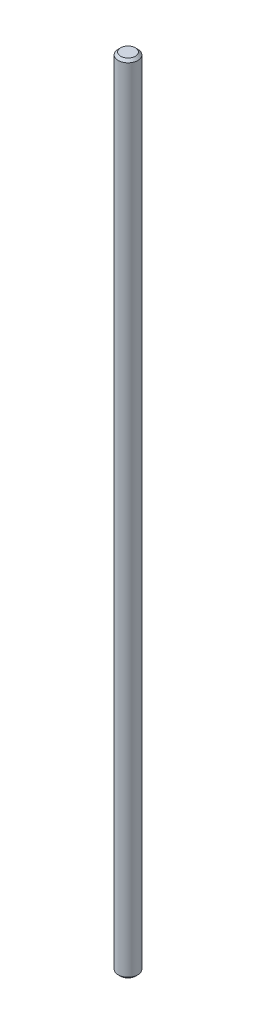
ISO-10303-21;
HEADER;
FILE_DESCRIPTION(('STEP AP214'),'2;1');
FILE_NAME('part.step','',(''),(''),'','','');
FILE_SCHEMA(('AUTOMOTIVE_DESIGN { 1 0 10303 214 1 1 1 1 }'));
ENDSEC;
DATA;
#1=APPLICATION_CONTEXT('core data for automotive mechanical design processes');
#2=APPLICATION_PROTOCOL_DEFINITION('international standard','automotive_design',2000,#1);
#3=PRODUCT_CONTEXT('',#1,'mechanical');
#4=PRODUCT('Part','Part','',(#3));
#5=PRODUCT_RELATED_PRODUCT_CATEGORY('part','',(#4));
#6=PRODUCT_DEFINITION_FORMATION('','',#4);
#7=PRODUCT_DEFINITION_CONTEXT('part definition',#1,'design');
#8=PRODUCT_DEFINITION('design','',#6,#7);
#9=PRODUCT_DEFINITION_SHAPE('','',#8);
#10=(LENGTH_UNIT() NAMED_UNIT(*) SI_UNIT(.MILLI.,.METRE.));
#11=(NAMED_UNIT(*) PLANE_ANGLE_UNIT() SI_UNIT($,.RADIAN.));
#12=(NAMED_UNIT(*) SI_UNIT($,.STERADIAN.) SOLID_ANGLE_UNIT());
#13=UNCERTAINTY_MEASURE_WITH_UNIT(LENGTH_MEASURE(1.E-05),#10,'distance_accuracy_value','');
#14=(GEOMETRIC_REPRESENTATION_CONTEXT(3) GLOBAL_UNCERTAINTY_ASSIGNED_CONTEXT((#13)) GLOBAL_UNIT_ASSIGNED_CONTEXT((#10,
#11,#12)) REPRESENTATION_CONTEXT('',''));
#15=CARTESIAN_POINT('',(0.,0.,0.));
#16=DIRECTION('',(0.,0.,1.));
#17=DIRECTION('',(1.,0.,0.));
#18=AXIS2_PLACEMENT_3D('',#15,#16,#17);
#19=CARTESIAN_POINT('',(0.,0.,0.));
#20=DIRECTION('',(0.,-1.,0.));
#21=DIRECTION('',(0.,0.,-1.));
#22=AXIS2_PLACEMENT_3D('',#19,#20,#21);
#23=PLANE('',#22);
#24=CARTESIAN_POINT('',(0.,0.,0.));
#25=DIRECTION('',(0.,-1.,0.));
#26=DIRECTION('',(0.,0.,-1.));
#27=AXIS2_PLACEMENT_3D('',#24,#25,#26);
#28=CIRCLE('',#27,3.07237287851167);
#29=CARTESIAN_POINT('',(0.,0.,-3.07237287851167));
#30=VERTEX_POINT('',#29);
#31=EDGE_CURVE('E10',#30,#30,#28,.T.);
#32=ORIENTED_EDGE('',*,*,#31,.T.);
#33=EDGE_LOOP('',(#32));
#34=FACE_BOUND('',#33,.T.);
#35=ADVANCED_FACE('F31',(#34),#23,.T.);
#36=CARTESIAN_POINT('',(0.,0.,0.));
#37=DIRECTION('',(0.,1.,0.));
#38=DIRECTION('',(0.,0.,1.));
#39=AXIS2_PLACEMENT_3D('',#36,#37,#38);
#40=CONICAL_SURFACE('',#39,3.07237287851167,0.785398163397525);
#41=CARTESIAN_POINT('',(0.,0.927627121488195,0.));
#42=DIRECTION('',(0.,-1.,0.));
#43=DIRECTION('',(0.,0.,-1.));
#44=AXIS2_PLACEMENT_3D('',#41,#42,#43);
#45=CIRCLE('',#44,4.);
#46=CARTESIAN_POINT('',(0.,0.927627121488209,-4.));
#47=VERTEX_POINT('',#46);
#48=EDGE_CURVE('E37',#47,#47,#45,.T.);
#49=ORIENTED_EDGE('',*,*,#48,.T.);
#50=EDGE_LOOP('',(#49));
#51=FACE_BOUND('',#50,.T.);
#52=ORIENTED_EDGE('',*,*,#31,.F.);
#53=EDGE_LOOP('',(#52));
#54=FACE_BOUND('',#53,.T.);
#55=ADVANCED_FACE('F63',(#51,#54),#40,.T.);
#56=CARTESIAN_POINT('',(0.,-514.881648804842,-1.79769966851489E-12));
#57=DIRECTION('',(0.,-1.,0.));
#58=DIRECTION('',(0.,0.,-1.));
#59=AXIS2_PLACEMENT_3D('',#56,#57,#58);
#60=CYLINDRICAL_SURFACE('',#59,4.00000000000057);
#61=CARTESIAN_POINT('',(0.,324.,1.13123995378517E-12));
#62=DIRECTION('',(0.,-1.,0.));
#63=DIRECTION('',(0.,0.,-1.));
#64=AXIS2_PLACEMENT_3D('',#61,#62,#63);
#65=CIRCLE('',#64,4.00000000000113);
#66=CARTESIAN_POINT('',(0.,324.,-4.));
#67=VERTEX_POINT('',#66);
#68=EDGE_CURVE('E41',#67,#67,#65,.T.);
#69=ORIENTED_EDGE('',*,*,#68,.T.);
#70=EDGE_LOOP('',(#69));
#71=FACE_BOUND('',#70,.T.);
#72=ORIENTED_EDGE('',*,*,#48,.F.);
#73=EDGE_LOOP('',(#72));
#74=FACE_BOUND('',#73,.T.);
#75=ADVANCED_FACE('F60',(#71,#74),#60,.T.);
#76=CARTESIAN_POINT('',(0.,324.,1.13123995378517E-12));
#77=DIRECTION('',(0.,-1.,0.));
#78=DIRECTION('',(0.,0.,-1.));
#79=AXIS2_PLACEMENT_3D('',#76,#77,#78);
#80=CONICAL_SURFACE('',#79,4.00000000000113,0.785398163397409);
#81=CARTESIAN_POINT('',(0.,325.,1.13473143512402E-12));
#82=DIRECTION('',(0.,-1.,0.));
#83=DIRECTION('',(0.,0.,-1.));
#84=AXIS2_PLACEMENT_3D('',#81,#82,#83);
#85=CIRCLE('',#84,3.0000000000011);
#86=CARTESIAN_POINT('',(0.,325.,-2.99999999999996));
#87=VERTEX_POINT('',#86);
#88=EDGE_CURVE('E45',#87,#87,#85,.T.);
#89=ORIENTED_EDGE('',*,*,#88,.T.);
#90=EDGE_LOOP('',(#89));
#91=FACE_BOUND('',#90,.T.);
#92=ORIENTED_EDGE('',*,*,#68,.F.);
#93=EDGE_LOOP('',(#92));
#94=FACE_BOUND('',#93,.T.);
#95=ADVANCED_FACE('F51',(#91,#94),#80,.T.);
#96=CARTESIAN_POINT('',(0.,325.,-2.99999999999996));
#97=DIRECTION('',(0.,1.,0.));
#98=DIRECTION('',(0.,0.,1.));
#99=AXIS2_PLACEMENT_3D('',#96,#97,#98);
#100=PLANE('',#99);
#101=ORIENTED_EDGE('',*,*,#88,.F.);
#102=EDGE_LOOP('',(#101));
#103=FACE_BOUND('',#102,.T.);
#104=ADVANCED_FACE('F54',(#103),#100,.T.);
#105=CLOSED_SHELL('',(#35,#55,#75,#95,#104));
#106=MANIFOLD_SOLID_BREP('B2',#105);
#107=ADVANCED_BREP_SHAPE_REPRESENTATION('',(#18,#106),#14);
#108=SHAPE_DEFINITION_REPRESENTATION(#9,#107);
ENDSEC;
END-ISO-10303-21;
